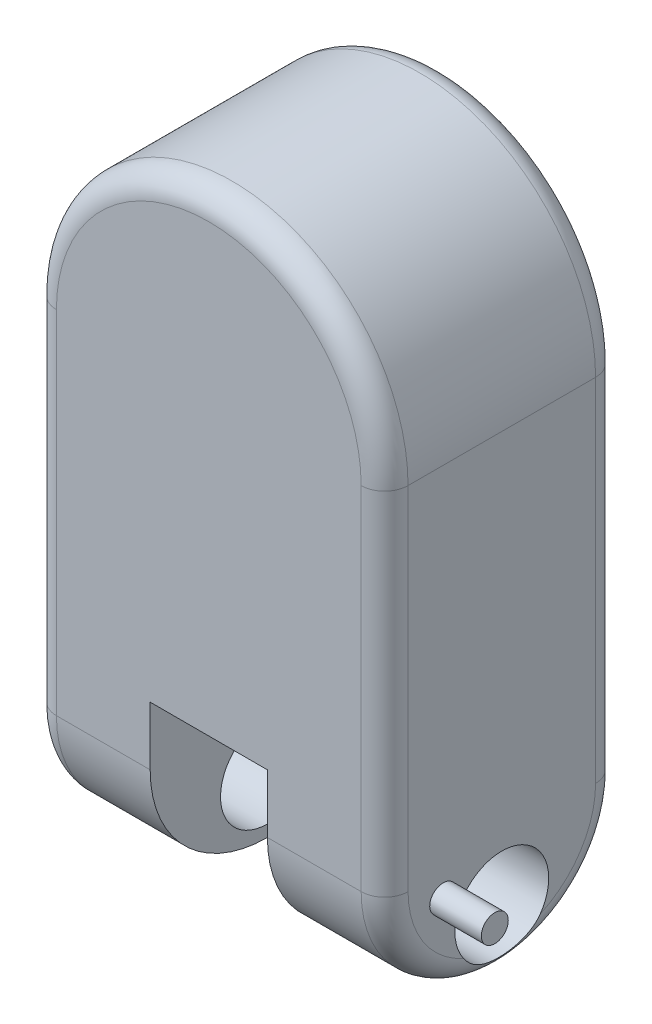
ISO-10303-21;
HEADER;
FILE_DESCRIPTION(('STEP AP214'),'2;1');
FILE_NAME('part.step','',(''),(''),'','','');
FILE_SCHEMA(('AUTOMOTIVE_DESIGN { 1 0 10303 214 1 1 1 1 }'));
ENDSEC;
DATA;
#1=APPLICATION_CONTEXT('core data for automotive mechanical design processes');
#2=APPLICATION_PROTOCOL_DEFINITION('international standard','automotive_design',2000,#1);
#3=PRODUCT_CONTEXT('',#1,'mechanical');
#4=PRODUCT('Part','Part','',(#3));
#5=PRODUCT_RELATED_PRODUCT_CATEGORY('part','',(#4));
#6=PRODUCT_DEFINITION_FORMATION('','',#4);
#7=PRODUCT_DEFINITION_CONTEXT('part definition',#1,'design');
#8=PRODUCT_DEFINITION('design','',#6,#7);
#9=PRODUCT_DEFINITION_SHAPE('','',#8);
#10=(LENGTH_UNIT() NAMED_UNIT(*) SI_UNIT(.MILLI.,.METRE.));
#11=(NAMED_UNIT(*) PLANE_ANGLE_UNIT() SI_UNIT($,.RADIAN.));
#12=(NAMED_UNIT(*) SI_UNIT($,.STERADIAN.) SOLID_ANGLE_UNIT());
#13=UNCERTAINTY_MEASURE_WITH_UNIT(LENGTH_MEASURE(1.E-05),#10,'distance_accuracy_value','');
#14=(GEOMETRIC_REPRESENTATION_CONTEXT(3) GLOBAL_UNCERTAINTY_ASSIGNED_CONTEXT((#13)) GLOBAL_UNIT_ASSIGNED_CONTEXT((#10,
#11,#12)) REPRESENTATION_CONTEXT('',''));
#15=CARTESIAN_POINT('',(0.,0.,0.));
#16=DIRECTION('',(0.,0.,1.));
#17=DIRECTION('',(1.,0.,0.));
#18=AXIS2_PLACEMENT_3D('',#15,#16,#17);
#19=CARTESIAN_POINT('',(-25.,-50.,-100.1));
#20=DIRECTION('',(0.,-1.,0.));
#21=DIRECTION('',(0.,0.,-1.));
#22=AXIS2_PLACEMENT_3D('',#19,#20,#21);
#23=PLANE('',#22);
#24=DIRECTION('',(1.,0.,0.));
#25=VECTOR('',#24,1.);
#26=CARTESIAN_POINT('',(-25.,-50.,-100.));
#27=LINE('',#26,#25);
#28=CARTESIAN_POINT('',(-25.,-50.,-100.));
#29=VERTEX_POINT('',#28);
#30=CARTESIAN_POINT('',(25.,-50.,-100.));
#31=VERTEX_POINT('',#30);
#32=EDGE_CURVE('E95',#29,#31,#27,.T.);
#33=ORIENTED_EDGE('',*,*,#32,.T.);
#34=CARTESIAN_POINT('',(23.5893264020334,-50.,-90.1));
#35=DIRECTION('',(0.,-1.,0.));
#36=DIRECTION('',(0.,0.,-1.));
#37=AXIS2_PLACEMENT_3D('',#34,#35,#36);
#38=CIRCLE('',#37,10.);
#39=CARTESIAN_POINT('',(23.5893264020334,-50.,-100.1));
#40=VERTEX_POINT('',#39);
#41=EDGE_CURVE('E12',#31,#40,#38,.F.);
#42=ORIENTED_EDGE('',*,*,#41,.T.);
#43=DIRECTION('',(1.,0.,0.));
#44=VECTOR('',#43,1.);
#45=CARTESIAN_POINT('',(-25.,-50.,-100.1));
#46=LINE('',#45,#44);
#47=CARTESIAN_POINT('',(-23.5893264020334,-50.,-100.1));
#48=VERTEX_POINT('',#47);
#49=EDGE_CURVE('E119',#48,#40,#46,.T.);
#50=ORIENTED_EDGE('',*,*,#49,.F.);
#51=CARTESIAN_POINT('',(-23.5893264020334,-50.,-90.1));
#52=DIRECTION('',(0.,-1.,0.));
#53=DIRECTION('',(0.,0.,-1.));
#54=AXIS2_PLACEMENT_3D('',#51,#52,#53);
#55=CIRCLE('',#54,10.);
#56=EDGE_CURVE('E58',#48,#29,#55,.F.);
#57=ORIENTED_EDGE('',*,*,#56,.T.);
#58=EDGE_LOOP('',(#33,#42,#50,#57));
#59=FACE_BOUND('',#58,.T.);
#60=ADVANCED_FACE('F49',(#59),#23,.F.);
#61=CARTESIAN_POINT('',(0.,0.,-100.1));
#62=DIRECTION('',(0.,0.,-1.));
#63=DIRECTION('',(-1.,0.,0.));
#64=AXIS2_PLACEMENT_3D('',#61,#62,#63);
#65=PLANE('',#64);
#66=ORIENTED_EDGE('',*,*,#49,.T.);
#67=DIRECTION('',(0.,1.,0.));
#68=VECTOR('',#67,1.);
#69=CARTESIAN_POINT('',(23.5893264020333,-80.,-100.1));
#70=LINE('',#69,#68);
#71=CARTESIAN_POINT('',(23.5893264020333,-78.5893264020334,-100.1));
#72=VERTEX_POINT('',#71);
#73=EDGE_CURVE('E107',#40,#72,#70,.F.);
#74=ORIENTED_EDGE('',*,*,#73,.T.);
#75=DIRECTION('',(1.,0.,0.));
#76=VECTOR('',#75,1.);
#77=CARTESIAN_POINT('',(-25.,-78.5893264020334,-100.1));
#78=LINE('',#77,#76);
#79=CARTESIAN_POINT('',(-23.5893264020334,-78.5893264020334,-100.1));
#80=VERTEX_POINT('',#79);
#81=EDGE_CURVE('E73',#72,#80,#78,.F.);
#82=ORIENTED_EDGE('',*,*,#81,.T.);
#83=DIRECTION('',(0.,-1.,0.));
#84=VECTOR('',#83,1.);
#85=CARTESIAN_POINT('',(-23.5893264020334,-50.,-100.1));
#86=LINE('',#85,#84);
#87=EDGE_CURVE('E110',#80,#48,#86,.F.);
#88=ORIENTED_EDGE('',*,*,#87,.T.);
#89=EDGE_LOOP('',(#66,#74,#82,#88));
#90=FACE_BOUND('',#89,.T.);
#91=ADVANCED_FACE('F123',(#90),#65,.T.);
#92=CARTESIAN_POINT('',(0.,0.,-100.));
#93=DIRECTION('',(0.,0.,-1.));
#94=DIRECTION('',(-1.,0.,0.));
#95=AXIS2_PLACEMENT_3D('',#92,#93,#94);
#96=PLANE('',#95);
#97=ORIENTED_EDGE('',*,*,#32,.F.);
#98=DIRECTION('',(0.,1.,0.));
#99=VECTOR('',#98,1.);
#100=CARTESIAN_POINT('',(-25.,-80.,-100.));
#101=LINE('',#100,#99);
#102=CARTESIAN_POINT('',(-25.,-80.,-100.));
#103=VERTEX_POINT('',#102);
#104=EDGE_CURVE('E118',#103,#29,#101,.T.);
#105=ORIENTED_EDGE('',*,*,#104,.F.);
#106=DIRECTION('',(-1.,0.,0.));
#107=VECTOR('',#106,1.);
#108=CARTESIAN_POINT('',(25.,-80.,-100.));
#109=LINE('',#108,#107);
#110=CARTESIAN_POINT('',(25.,-80.,-100.));
#111=VERTEX_POINT('',#110);
#112=EDGE_CURVE('E98',#111,#103,#109,.T.);
#113=ORIENTED_EDGE('',*,*,#112,.F.);
#114=DIRECTION('',(0.,-1.,0.));
#115=VECTOR('',#114,1.);
#116=CARTESIAN_POINT('',(25.,-50.,-100.));
#117=LINE('',#116,#115);
#118=EDGE_CURVE('E92',#31,#111,#117,.T.);
#119=ORIENTED_EDGE('',*,*,#118,.F.);
#120=EDGE_LOOP('',(#97,#105,#113,#119));
#121=FACE_BOUND('',#120,.T.);
#122=ADVANCED_FACE('F94',(#121),#96,.F.);
#123=CARTESIAN_POINT('',(-23.5893264020334,-80.,-90.1));
#124=DIRECTION('',(0.,1.,0.));
#125=DIRECTION('',(0.,0.,1.));
#126=AXIS2_PLACEMENT_3D('',#123,#124,#125);
#127=CYLINDRICAL_SURFACE('',#126,10.);
#128=ORIENTED_EDGE('',*,*,#56,.F.);
#129=ORIENTED_EDGE('',*,*,#87,.F.);
#130=CARTESIAN_POINT('',(-23.5893264020334,-78.5893264020334,-90.1));
#131=DIRECTION('',(-0.707106781186547,0.707106781186547,0.));
#132=DIRECTION('',(0.707106781186547,0.707106781186547,0.));
#133=AXIS2_PLACEMENT_3D('',#130,#131,#132);
#134=ELLIPSE('',#133,14.1421356237309,10.);
#135=EDGE_CURVE('E53',#103,#80,#134,.F.);
#136=ORIENTED_EDGE('',*,*,#135,.F.);
#137=ORIENTED_EDGE('',*,*,#104,.T.);
#138=EDGE_LOOP('',(#128,#129,#136,#137));
#139=FACE_BOUND('',#138,.T.);
#140=ADVANCED_FACE('F51',(#139),#127,.T.);
#141=CARTESIAN_POINT('',(25.,-78.5893264020334,-90.1));
#142=DIRECTION('',(-1.,0.,0.));
#143=DIRECTION('',(0.,0.,1.));
#144=AXIS2_PLACEMENT_3D('',#141,#142,#143);
#145=CYLINDRICAL_SURFACE('',#144,10.);
#146=ORIENTED_EDGE('',*,*,#135,.T.);
#147=ORIENTED_EDGE('',*,*,#81,.F.);
#148=CARTESIAN_POINT('',(23.5893264020333,-78.5893264020334,-90.1));
#149=DIRECTION('',(-0.707106781186548,-0.707106781186547,0.));
#150=DIRECTION('',(-0.707106781186547,0.707106781186548,0.));
#151=AXIS2_PLACEMENT_3D('',#148,#149,#150);
#152=ELLIPSE('',#151,14.1421356237309,10.);
#153=EDGE_CURVE('E66',#111,#72,#152,.F.);
#154=ORIENTED_EDGE('',*,*,#153,.F.);
#155=ORIENTED_EDGE('',*,*,#112,.T.);
#156=EDGE_LOOP('',(#146,#147,#154,#155));
#157=FACE_BOUND('',#156,.T.);
#158=ADVANCED_FACE('F116',(#157),#145,.T.);
#159=CARTESIAN_POINT('',(23.5893264020334,-50.,-90.1));
#160=DIRECTION('',(0.,-1.,0.));
#161=DIRECTION('',(1.,0.,0.));
#162=AXIS2_PLACEMENT_3D('',#159,#160,#161);
#163=CYLINDRICAL_SURFACE('',#162,10.);
#164=ORIENTED_EDGE('',*,*,#41,.F.);
#165=ORIENTED_EDGE('',*,*,#118,.T.);
#166=ORIENTED_EDGE('',*,*,#153,.T.);
#167=ORIENTED_EDGE('',*,*,#73,.F.);
#168=EDGE_LOOP('',(#164,#165,#166,#167));
#169=FACE_BOUND('',#168,.T.);
#170=ADVANCED_FACE('F106',(#169),#163,.T.);
#171=CLOSED_SHELL('',(#60,#91,#122,#140,#158,#170));
#172=MANIFOLD_SOLID_BREP('B2',#171);
#173=CARTESIAN_POINT('',(0.,-50.,-50.));
#174=DIRECTION('',(1.,0.,0.));
#175=DIRECTION('',(0.,0.,-1.));
#176=AXIS2_PLACEMENT_3D('',#173,#174,#175);
#177=CYLINDRICAL_SURFACE('',#176,50.);
#178=DIRECTION('',(1.,0.,0.));
#179=VECTOR('',#178,1.);
#180=CARTESIAN_POINT('',(0.,-50.,0.));
#181=LINE('',#180,#179);
#182=CARTESIAN_POINT('',(-65.,-50.,0.));
#183=VERTEX_POINT('',#182);
#184=CARTESIAN_POINT('',(-25.,-50.,0.));
#185=VERTEX_POINT('',#184);
#186=EDGE_CURVE('E373',#183,#185,#181,.T.);
#187=ORIENTED_EDGE('',*,*,#186,.F.);
#188=CARTESIAN_POINT('',(-65.,-50.,-50.));
#189=DIRECTION('',(-1.,0.,0.));
#190=DIRECTION('',(0.,-1.,0.));
#191=AXIS2_PLACEMENT_3D('',#188,#189,#190);
#192=CIRCLE('',#191,50.);
#193=CARTESIAN_POINT('',(-65.,-100.,-50.));
#194=VERTEX_POINT('',#193);
#195=EDGE_CURVE('E195',#183,#194,#192,.F.);
#196=ORIENTED_EDGE('',*,*,#195,.T.);
#197=DIRECTION('',(1.,0.,0.));
#198=VECTOR('',#197,1.);
#199=CARTESIAN_POINT('',(-75.,-100.,-50.));
#200=LINE('',#199,#198);
#201=CARTESIAN_POINT('',(-25.,-100.,-50.));
#202=VERTEX_POINT('',#201);
#203=EDGE_CURVE('E340',#202,#194,#200,.F.);
#204=ORIENTED_EDGE('',*,*,#203,.F.);
#205=CARTESIAN_POINT('',(-25.,-50.,-50.));
#206=DIRECTION('',(-1.,0.,0.));
#207=DIRECTION('',(0.,0.,1.));
#208=AXIS2_PLACEMENT_3D('',#205,#206,#207);
#209=CIRCLE('',#208,50.);
#210=EDGE_CURVE('E355',#185,#202,#209,.F.);
#211=ORIENTED_EDGE('',*,*,#210,.F.);
#212=EDGE_LOOP('',(#187,#196,#204,#211));
#213=FACE_BOUND('',#212,.T.);
#214=ADVANCED_FACE('F173',(#213),#177,.T.);
#215=CARTESIAN_POINT('',(-75.,-50.,-50.));
#216=DIRECTION('',(-1.,0.,0.));
#217=DIRECTION('',(0.,0.,1.));
#218=AXIS2_PLACEMENT_3D('',#215,#216,#217);
#219=CYLINDRICAL_SURFACE('',#218,50.);
#220=ORIENTED_EDGE('',*,*,#203,.T.);
#221=CARTESIAN_POINT('',(-65.,-50.,-50.));
#222=DIRECTION('',(-1.,0.,0.));
#223=DIRECTION('',(0.,-1.,0.));
#224=AXIS2_PLACEMENT_3D('',#221,#222,#223);
#225=CIRCLE('',#224,50.);
#226=CARTESIAN_POINT('',(-65.,-50.,-100.));
#227=VERTEX_POINT('',#226);
#228=EDGE_CURVE('E181',#194,#227,#225,.F.);
#229=ORIENTED_EDGE('',*,*,#228,.T.);
#230=DIRECTION('',(1.,0.,0.));
#231=VECTOR('',#230,1.);
#232=CARTESIAN_POINT('',(-75.,-50.,-100.));
#233=LINE('',#232,#231);
#234=CARTESIAN_POINT('',(-25.,-50.,-100.));
#235=VERTEX_POINT('',#234);
#236=EDGE_CURVE('E369',#235,#227,#233,.F.);
#237=ORIENTED_EDGE('',*,*,#236,.F.);
#238=CARTESIAN_POINT('',(-25.,-50.,-50.));
#239=DIRECTION('',(-1.,0.,0.));
#240=DIRECTION('',(0.,0.,1.));
#241=AXIS2_PLACEMENT_3D('',#238,#239,#240);
#242=CIRCLE('',#241,50.);
#243=EDGE_CURVE('E361',#202,#235,#242,.F.);
#244=ORIENTED_EDGE('',*,*,#243,.F.);
#245=EDGE_LOOP('',(#220,#229,#237,#244));
#246=FACE_BOUND('',#245,.T.);
#247=ADVANCED_FACE('F472',(#246),#219,.T.);
#248=CARTESIAN_POINT('',(75.,100.,-100.));
#249=DIRECTION('',(1.,0.,0.));
#250=DIRECTION('',(0.,1.,0.));
#251=AXIS2_PLACEMENT_3D('',#248,#249,#250);
#252=PLANE('',#251);
#253=CARTESIAN_POINT('',(75.,-60.,-25.));
#254=DIRECTION('',(1.,0.,0.));
#255=DIRECTION('',(0.,1.,0.));
#256=AXIS2_PLACEMENT_3D('',#253,#254,#255);
#257=CIRCLE('',#256,5.75);
#258=CARTESIAN_POINT('',(75.,-54.25,-25.));
#259=VERTEX_POINT('',#258);
#260=EDGE_CURVE('E616',#259,#259,#257,.T.);
#261=ORIENTED_EDGE('',*,*,#260,.F.);
#262=EDGE_LOOP('',(#261));
#263=FACE_BOUND('',#262,.T.);
#264=CARTESIAN_POINT('',(75.,-50.,-50.));
#265=DIRECTION('',(1.,0.,0.));
#266=DIRECTION('',(0.,1.,0.));
#267=AXIS2_PLACEMENT_3D('',#264,#265,#266);
#268=CIRCLE('',#267,40.);
#269=CARTESIAN_POINT('',(75.,-86.5,-66.3630681719536));
#270=VERTEX_POINT('',#269);
#271=CARTESIAN_POINT('',(75.,-50.,-90.));
#272=VERTEX_POINT('',#271);
#273=EDGE_CURVE('E395',#270,#272,#268,.T.);
#274=ORIENTED_EDGE('',*,*,#273,.T.);
#275=DIRECTION('',(0.,1.,0.));
#276=VECTOR('',#275,1.);
#277=CARTESIAN_POINT('',(75.,100.,-90.));
#278=LINE('',#277,#276);
#279=CARTESIAN_POINT('',(75.,100.,-90.));
#280=VERTEX_POINT('',#279);
#281=EDGE_CURVE('E397',#272,#280,#278,.T.);
#282=ORIENTED_EDGE('',*,*,#281,.T.);
#283=DIRECTION('',(0.,0.,1.));
#284=VECTOR('',#283,1.);
#285=CARTESIAN_POINT('',(75.,100.,-100.));
#286=LINE('',#285,#284);
#287=CARTESIAN_POINT('',(75.,100.,-9.99999999999999));
#288=VERTEX_POINT('',#287);
#289=EDGE_CURVE('E351',#280,#288,#286,.T.);
#290=ORIENTED_EDGE('',*,*,#289,.T.);
#291=DIRECTION('',(0.,1.,0.));
#292=VECTOR('',#291,1.);
#293=CARTESIAN_POINT('',(75.,100.,-9.99999999999999));
#294=LINE('',#293,#292);
#295=CARTESIAN_POINT('',(75.,-50.,-10.));
#296=VERTEX_POINT('',#295);
#297=EDGE_CURVE('E391',#288,#296,#294,.F.);
#298=ORIENTED_EDGE('',*,*,#297,.T.);
#299=CARTESIAN_POINT('',(75.,-50.,-50.));
#300=DIRECTION('',(1.,0.,0.));
#301=DIRECTION('',(0.,1.,0.));
#302=AXIS2_PLACEMENT_3D('',#299,#300,#301);
#303=CIRCLE('',#302,40.);
#304=CARTESIAN_POINT('',(75.,-86.5,-33.6369318280464));
#305=VERTEX_POINT('',#304);
#306=EDGE_CURVE('E393',#296,#305,#303,.T.);
#307=ORIENTED_EDGE('',*,*,#306,.T.);
#308=CARTESIAN_POINT('',(75.,-75.,-50.));
#309=DIRECTION('',(-1.,0.,0.));
#310=DIRECTION('',(0.,-1.,0.));
#311=AXIS2_PLACEMENT_3D('',#308,#309,#310);
#312=CIRCLE('',#311,20.);
#313=EDGE_CURVE('E341',#305,#270,#312,.T.);
#314=ORIENTED_EDGE('',*,*,#313,.T.);
#315=EDGE_LOOP('',(#274,#282,#290,#298,#307,#314));
#316=FACE_BOUND('',#315,.T.);
#317=ADVANCED_FACE('F477',(#263,#316),#252,.T.);
#318=CARTESIAN_POINT('',(-75.,100.,-100.));
#319=DIRECTION('',(-1.,0.,0.));
#320=DIRECTION('',(0.,-1.,0.));
#321=AXIS2_PLACEMENT_3D('',#318,#319,#320);
#322=PLANE('',#321);
#323=CARTESIAN_POINT('',(-75.,-50.,-50.));
#324=DIRECTION('',(-1.,0.,0.));
#325=DIRECTION('',(0.,-1.,0.));
#326=AXIS2_PLACEMENT_3D('',#323,#324,#325);
#327=CIRCLE('',#326,40.);
#328=CARTESIAN_POINT('',(-75.,-86.5,-33.6369318280464));
#329=VERTEX_POINT('',#328);
#330=CARTESIAN_POINT('',(-75.,-50.,-10.));
#331=VERTEX_POINT('',#330);
#332=EDGE_CURVE('E545',#329,#331,#327,.T.);
#333=ORIENTED_EDGE('',*,*,#332,.T.);
#334=DIRECTION('',(0.,-1.,0.));
#335=VECTOR('',#334,1.);
#336=CARTESIAN_POINT('',(-75.,100.,-9.99999999999999));
#337=LINE('',#336,#335);
#338=CARTESIAN_POINT('',(-75.,100.,-9.99999999999999));
#339=VERTEX_POINT('',#338);
#340=EDGE_CURVE('E443',#331,#339,#337,.F.);
#341=ORIENTED_EDGE('',*,*,#340,.T.);
#342=DIRECTION('',(0.,0.,1.));
#343=VECTOR('',#342,1.);
#344=CARTESIAN_POINT('',(-75.,100.,-100.));
#345=LINE('',#344,#343);
#346=CARTESIAN_POINT('',(-75.,100.,-90.));
#347=VERTEX_POINT('',#346);
#348=EDGE_CURVE('E352',#347,#339,#345,.T.);
#349=ORIENTED_EDGE('',*,*,#348,.F.);
#350=DIRECTION('',(0.,-1.,0.));
#351=VECTOR('',#350,1.);
#352=CARTESIAN_POINT('',(-75.,-50.,-90.));
#353=LINE('',#352,#351);
#354=CARTESIAN_POINT('',(-75.,-50.,-90.));
#355=VERTEX_POINT('',#354);
#356=EDGE_CURVE('E539',#347,#355,#353,.T.);
#357=ORIENTED_EDGE('',*,*,#356,.T.);
#358=CARTESIAN_POINT('',(-75.,-50.,-50.));
#359=DIRECTION('',(-1.,0.,0.));
#360=DIRECTION('',(0.,-1.,0.));
#361=AXIS2_PLACEMENT_3D('',#358,#359,#360);
#362=CIRCLE('',#361,40.);
#363=CARTESIAN_POINT('',(-75.,-86.5,-66.3630681719536));
#364=VERTEX_POINT('',#363);
#365=EDGE_CURVE('E544',#355,#364,#362,.T.);
#366=ORIENTED_EDGE('',*,*,#365,.T.);
#367=CARTESIAN_POINT('',(-75.,-75.,-50.));
#368=DIRECTION('',(-1.,0.,0.));
#369=DIRECTION('',(0.,-1.,0.));
#370=AXIS2_PLACEMENT_3D('',#367,#368,#369);
#371=CIRCLE('',#370,20.);
#372=EDGE_CURVE('E345',#329,#364,#371,.T.);
#373=ORIENTED_EDGE('',*,*,#372,.F.);
#374=EDGE_LOOP('',(#333,#341,#349,#357,#366,#373));
#375=FACE_BOUND('',#374,.T.);
#376=ADVANCED_FACE('F550',(#375),#322,.T.);
#377=CARTESIAN_POINT('',(0.,0.,-100.));
#378=DIRECTION('',(0.,0.,1.));
#379=DIRECTION('',(1.,0.,0.));
#380=AXIS2_PLACEMENT_3D('',#377,#378,#379);
#381=PLANE('',#380);
#382=CARTESIAN_POINT('',(0.,100.,-100.));
#383=DIRECTION('',(0.,0.,1.));
#384=DIRECTION('',(1.,0.,0.));
#385=AXIS2_PLACEMENT_3D('',#382,#383,#384);
#386=CIRCLE('',#385,65.);
#387=CARTESIAN_POINT('',(-65.,100.,-100.));
#388=VERTEX_POINT('',#387);
#389=CARTESIAN_POINT('',(65.,100.,-100.));
#390=VERTEX_POINT('',#389);
#391=EDGE_CURVE('E386',#388,#390,#386,.F.);
#392=ORIENTED_EDGE('',*,*,#391,.T.);
#393=DIRECTION('',(0.,1.,0.));
#394=VECTOR('',#393,1.);
#395=CARTESIAN_POINT('',(65.,-50.,-100.));
#396=LINE('',#395,#394);
#397=CARTESIAN_POINT('',(65.,-50.,-100.));
#398=VERTEX_POINT('',#397);
#399=EDGE_CURVE('E389',#390,#398,#396,.F.);
#400=ORIENTED_EDGE('',*,*,#399,.T.);
#401=CARTESIAN_POINT('',(25.,-50.,-100.));
#402=VERTEX_POINT('',#401);
#403=EDGE_CURVE('E374',#398,#402,#233,.F.);
#404=ORIENTED_EDGE('',*,*,#403,.T.);
#405=DIRECTION('',(-1.,0.,0.));
#406=VECTOR('',#405,1.);
#407=CARTESIAN_POINT('',(-25.,-50.,-100.));
#408=LINE('',#407,#406);
#409=EDGE_CURVE('E334',#402,#235,#408,.T.);
#410=ORIENTED_EDGE('',*,*,#409,.T.);
#411=ORIENTED_EDGE('',*,*,#236,.T.);
#412=DIRECTION('',(0.,-1.,0.));
#413=VECTOR('',#412,1.);
#414=CARTESIAN_POINT('',(-65.,100.,-100.));
#415=LINE('',#414,#413);
#416=EDGE_CURVE('E384',#227,#388,#415,.F.);
#417=ORIENTED_EDGE('',*,*,#416,.T.);
#418=EDGE_LOOP('',(#392,#400,#404,#410,#411,#417));
#419=FACE_BOUND('',#418,.T.);
#420=ADVANCED_FACE('F589',(#419),#381,.F.);
#421=CARTESIAN_POINT('',(0.,0.,0.));
#422=DIRECTION('',(0.,0.,1.));
#423=DIRECTION('',(1.,0.,0.));
#424=AXIS2_PLACEMENT_3D('',#421,#422,#423);
#425=PLANE('',#424);
#426=DIRECTION('',(0.,-1.,0.));
#427=VECTOR('',#426,1.);
#428=CARTESIAN_POINT('',(-25.,-50.,0.));
#429=LINE('',#428,#427);
#430=CARTESIAN_POINT('',(-25.,-25.,0.));
#431=VERTEX_POINT('',#430);
#432=EDGE_CURVE('E317',#431,#185,#429,.T.);
#433=ORIENTED_EDGE('',*,*,#432,.F.);
#434=DIRECTION('',(-1.,0.,0.));
#435=VECTOR('',#434,1.);
#436=CARTESIAN_POINT('',(-25.,-25.,0.));
#437=LINE('',#436,#435);
#438=CARTESIAN_POINT('',(25.,-25.,0.));
#439=VERTEX_POINT('',#438);
#440=EDGE_CURVE('E325',#439,#431,#437,.T.);
#441=ORIENTED_EDGE('',*,*,#440,.F.);
#442=DIRECTION('',(0.,1.,0.));
#443=VECTOR('',#442,1.);
#444=CARTESIAN_POINT('',(25.,-25.,0.));
#445=LINE('',#444,#443);
#446=CARTESIAN_POINT('',(25.,-50.,0.));
#447=VERTEX_POINT('',#446);
#448=EDGE_CURVE('E308',#447,#439,#445,.T.);
#449=ORIENTED_EDGE('',*,*,#448,.F.);
#450=CARTESIAN_POINT('',(65.,-50.,0.));
#451=VERTEX_POINT('',#450);
#452=EDGE_CURVE('E376',#447,#451,#181,.T.);
#453=ORIENTED_EDGE('',*,*,#452,.T.);
#454=DIRECTION('',(0.,1.,0.));
#455=VECTOR('',#454,1.);
#456=CARTESIAN_POINT('',(65.,0.,0.));
#457=LINE('',#456,#455);
#458=CARTESIAN_POINT('',(65.,100.,0.));
#459=VERTEX_POINT('',#458);
#460=EDGE_CURVE('E530',#451,#459,#457,.T.);
#461=ORIENTED_EDGE('',*,*,#460,.T.);
#462=CARTESIAN_POINT('',(0.,100.,0.));
#463=DIRECTION('',(0.,0.,1.));
#464=DIRECTION('',(1.,0.,0.));
#465=AXIS2_PLACEMENT_3D('',#462,#463,#464);
#466=CIRCLE('',#465,65.);
#467=CARTESIAN_POINT('',(-65.,100.,0.));
#468=VERTEX_POINT('',#467);
#469=EDGE_CURVE('E535',#459,#468,#466,.T.);
#470=ORIENTED_EDGE('',*,*,#469,.T.);
#471=DIRECTION('',(0.,-1.,0.));
#472=VECTOR('',#471,1.);
#473=CARTESIAN_POINT('',(-65.,0.,0.));
#474=LINE('',#473,#472);
#475=EDGE_CURVE('E504',#468,#183,#474,.T.);
#476=ORIENTED_EDGE('',*,*,#475,.T.);
#477=ORIENTED_EDGE('',*,*,#186,.T.);
#478=EDGE_LOOP('',(#433,#441,#449,#453,#461,#470,#476,#477));
#479=FACE_BOUND('',#478,.T.);
#480=ADVANCED_FACE('F599',(#479),#425,.T.);
#481=CARTESIAN_POINT('',(25.,-125.,-100.));
#482=DIRECTION('',(1.,0.,0.));
#483=DIRECTION('',(0.,0.,-1.));
#484=AXIS2_PLACEMENT_3D('',#481,#482,#483);
#485=PLANE('',#484);
#486=CARTESIAN_POINT('',(25.,-50.,-50.));
#487=DIRECTION('',(1.,0.,0.));
#488=DIRECTION('',(0.,0.,-1.));
#489=AXIS2_PLACEMENT_3D('',#486,#487,#488);
#490=CIRCLE('',#489,50.);
#491=CARTESIAN_POINT('',(25.,-100.,-50.));
#492=VERTEX_POINT('',#491);
#493=EDGE_CURVE('E364',#492,#447,#490,.F.);
#494=ORIENTED_EDGE('',*,*,#493,.T.);
#495=ORIENTED_EDGE('',*,*,#448,.T.);
#496=DIRECTION('',(0.,0.,1.));
#497=VECTOR('',#496,1.);
#498=CARTESIAN_POINT('',(25.,-25.,-99.));
#499=LINE('',#498,#497);
#500=CARTESIAN_POINT('',(25.,-25.,-99.));
#501=VERTEX_POINT('',#500);
#502=EDGE_CURVE('E300',#501,#439,#499,.T.);
#503=ORIENTED_EDGE('',*,*,#502,.F.);
#504=DIRECTION('',(0.,1.,0.));
#505=VECTOR('',#504,1.);
#506=CARTESIAN_POINT('',(25.,-25.,-99.));
#507=LINE('',#506,#505);
#508=CARTESIAN_POINT('',(25.,-49.4302970896538,-99.));
#509=VERTEX_POINT('',#508);
#510=EDGE_CURVE('E306',#509,#501,#507,.T.);
#511=ORIENTED_EDGE('',*,*,#510,.F.);
#512=CARTESIAN_POINT('',(25.,-136.602540378444,-50.));
#513=DIRECTION('',(1.,0.,0.));
#514=DIRECTION('',(0.,0.,-1.));
#515=AXIS2_PLACEMENT_3D('',#512,#513,#514);
#516=CIRCLE('',#515,100.);
#517=EDGE_CURVE('E335',#402,#509,#516,.T.);
#518=ORIENTED_EDGE('',*,*,#517,.F.);
#519=CARTESIAN_POINT('',(25.,-50.,-50.));
#520=DIRECTION('',(1.,0.,0.));
#521=DIRECTION('',(0.,0.,-1.));
#522=AXIS2_PLACEMENT_3D('',#519,#520,#521);
#523=CIRCLE('',#522,50.);
#524=EDGE_CURVE('E366',#402,#492,#523,.F.);
#525=ORIENTED_EDGE('',*,*,#524,.T.);
#526=EDGE_LOOP('',(#494,#495,#503,#511,#518,#525));
#527=FACE_BOUND('',#526,.T.);
#528=CARTESIAN_POINT('',(25.,-75.,-50.));
#529=DIRECTION('',(1.,0.,0.));
#530=DIRECTION('',(0.,0.,-1.));
#531=AXIS2_PLACEMENT_3D('',#528,#529,#530);
#532=CIRCLE('',#531,20.);
#533=CARTESIAN_POINT('',(25.,-75.,-70.));
#534=VERTEX_POINT('',#533);
#535=EDGE_CURVE('E348',#534,#534,#532,.T.);
#536=ORIENTED_EDGE('',*,*,#535,.T.);
#537=EDGE_LOOP('',(#536));
#538=FACE_BOUND('',#537,.T.);
#539=ADVANCED_FACE('F303',(#527,#538),#485,.F.);
#540=CARTESIAN_POINT('',(-25.,-125.,-100.));
#541=DIRECTION('',(-1.,0.,0.));
#542=DIRECTION('',(0.,0.,1.));
#543=AXIS2_PLACEMENT_3D('',#540,#541,#542);
#544=PLANE('',#543);
#545=ORIENTED_EDGE('',*,*,#432,.T.);
#546=ORIENTED_EDGE('',*,*,#210,.T.);
#547=ORIENTED_EDGE('',*,*,#243,.T.);
#548=CARTESIAN_POINT('',(-25.,-136.602540378444,-50.));
#549=DIRECTION('',(1.,0.,0.));
#550=DIRECTION('',(0.,0.,-1.));
#551=AXIS2_PLACEMENT_3D('',#548,#549,#550);
#552=CIRCLE('',#551,100.);
#553=CARTESIAN_POINT('',(-25.,-49.4302970896538,-99.));
#554=VERTEX_POINT('',#553);
#555=EDGE_CURVE('E331',#235,#554,#552,.T.);
#556=ORIENTED_EDGE('',*,*,#555,.T.);
#557=DIRECTION('',(0.,-1.,0.));
#558=VECTOR('',#557,1.);
#559=CARTESIAN_POINT('',(-25.,-50.,-99.));
#560=LINE('',#559,#558);
#561=CARTESIAN_POINT('',(-25.,-25.,-99.));
#562=VERTEX_POINT('',#561);
#563=EDGE_CURVE('E188',#562,#554,#560,.T.);
#564=ORIENTED_EDGE('',*,*,#563,.F.);
#565=DIRECTION('',(0.,0.,1.));
#566=VECTOR('',#565,1.);
#567=CARTESIAN_POINT('',(-25.,-25.,-99.));
#568=LINE('',#567,#566);
#569=EDGE_CURVE('E313',#562,#431,#568,.T.);
#570=ORIENTED_EDGE('',*,*,#569,.T.);
#571=EDGE_LOOP('',(#545,#546,#547,#556,#564,#570));
#572=FACE_BOUND('',#571,.T.);
#573=CARTESIAN_POINT('',(-25.,-75.,-50.));
#574=DIRECTION('',(-1.,0.,0.));
#575=DIRECTION('',(0.,0.,1.));
#576=AXIS2_PLACEMENT_3D('',#573,#574,#575);
#577=CIRCLE('',#576,20.);
#578=CARTESIAN_POINT('',(-25.,-75.,-30.));
#579=VERTEX_POINT('',#578);
#580=EDGE_CURVE('E344',#579,#579,#577,.T.);
#581=ORIENTED_EDGE('',*,*,#580,.T.);
#582=EDGE_LOOP('',(#581));
#583=FACE_BOUND('',#582,.T.);
#584=ADVANCED_FACE('F428',(#572,#583),#544,.F.);
#585=CARTESIAN_POINT('',(75.,-75.,-50.));
#586=DIRECTION('',(-1.,0.,0.));
#587=DIRECTION('',(0.,-1.,0.));
#588=AXIS2_PLACEMENT_3D('',#585,#586,#587);
#589=CYLINDRICAL_SURFACE('',#588,20.);
#590=CARTESIAN_POINT('',(-75.,-86.5,-66.3630681719536));
#591=CARTESIAN_POINT('',(-74.9999944988369,-86.7176357862937,-66.2101150233158));
#592=CARTESIAN_POINT('',(-74.9972251505423,-86.9321820247623,-66.0528421805292));
#593=CARTESIAN_POINT('',(-74.9867556613727,-87.3547338877603,-65.7299474304971));
#594=CARTESIAN_POINT('',(-74.9790561221654,-87.5627403071429,-65.5643265442969));
#595=CARTESIAN_POINT('',(-74.9494718778201,-88.1761618147391,-65.0555886797702));
#596=CARTESIAN_POINT('',(-74.9210996400918,-88.5713253297654,-64.7003530754296));
#597=CARTESIAN_POINT('',(-74.8515096756831,-89.3308118956316,-63.9609577577296));
#598=CARTESIAN_POINT('',(-74.8103152955771,-89.6951894805873,-63.576851568469));
#599=CARTESIAN_POINT('',(-74.7190573029856,-90.3919502085838,-62.7815251896324));
#600=CARTESIAN_POINT('',(-74.6689923089183,-90.7243283553076,-62.3703007827167));
#601=CARTESIAN_POINT('',(-74.5631593930954,-91.3586189763568,-61.5187034560061));
#602=CARTESIAN_POINT('',(-74.5073357106278,-91.6601635821769,-61.0780636594513));
#603=CARTESIAN_POINT('',(-74.3940622995594,-92.2269934381917,-60.1742441935076));
#604=CARTESIAN_POINT('',(-74.3366125479803,-92.4922781756816,-59.7110642055319));
#605=CARTESIAN_POINT('',(-74.223501755816,-92.9850540297158,-58.7648363026767));
#606=CARTESIAN_POINT('',(-74.167840615512,-93.2125472561706,-58.2817894988468));
#607=CARTESIAN_POINT('',(-74.0614849028067,-93.6283633257279,-57.2985605452277));
#608=CARTESIAN_POINT('',(-74.0107905215469,-93.816684661646,-56.7983777369727));
#609=CARTESIAN_POINT('',(-73.914628020795,-94.1623352522272,-55.7553050669512));
#610=CARTESIAN_POINT('',(-73.8696146444547,-94.3173235958303,-55.2115959974652));
#611=CARTESIAN_POINT('',(-73.7912772213223,-94.5808561419918,-54.1121164115953));
#612=CARTESIAN_POINT('',(-73.7579530630838,-94.6894007873518,-53.5563460102591));
#613=CARTESIAN_POINT('',(-73.7183397843355,-94.8167523648337,-52.7160701639446));
#614=CARTESIAN_POINT('',(-73.7068534918599,-94.8533239412986,-52.434388327726));
#615=CARTESIAN_POINT('',(-73.6875556329067,-94.9144503803222,-51.869577925022));
#616=CARTESIAN_POINT('',(-73.6797440577708,-94.9390052711948,-51.586449361947));
#617=CARTESIAN_POINT('',(-73.6679366207012,-94.9760341632624,-51.0192418997108));
#618=CARTESIAN_POINT('',(-73.6639419207102,-94.988504485659,-50.7351627375597));
#619=CARTESIAN_POINT('',(-73.6598264732936,-95.0013273397729,-50.1666967726029));
#620=CARTESIAN_POINT('',(-73.6597058137055,-95.0016795967333,-49.882309962968));
#621=CARTESIAN_POINT('',(-73.6615493262836,-94.9959605824914,-49.5980542531014));
#622=B_SPLINE_CURVE_WITH_KNOTS('',3,(#590,#591,#592,#593,#594,#595,#596,#597,#598,#599,#600,
#601,#602,#603,#604,#605,#606,#607,#608,#609,#610,#611,#612,#613,#614,#615,#616,#617,#618,#619,
#620,#621),.UNSPECIFIED.,.F.,.F.,(4,2,2,2,2,2,2,2,2,2,2,2,2,2,2,4),(0.,0.797874642750549,
1.59565193352407,3.1899412608992,4.78134451960052,6.37299585463969,7.98184001143662,
9.59070691451072,11.1994839638915,12.8083229014095,14.5077128583875,16.2070866127463,
17.0596892460926,17.91228987052,18.7651499631725,19.6180293930039),.UNSPECIFIED.);
#623=CARTESIAN_POINT('',(-73.6602540378444,-95.,-50.));
#624=VERTEX_POINT('',#623);
#625=EDGE_CURVE('E435',#364,#624,#622,.T.);
#626=ORIENTED_EDGE('',*,*,#625,.T.);
#627=CARTESIAN_POINT('',(-73.6602540378444,-95.,-50.));
#628=CARTESIAN_POINT('',(-73.660247528865,-95.0000005574234,-49.7291162562174));
#629=CARTESIAN_POINT('',(-73.6620203059655,-94.9944957155756,-49.4582663052626));
#630=CARTESIAN_POINT('',(-73.6690632302412,-94.9724962896712,-48.9170644816353));
#631=CARTESIAN_POINT('',(-73.6743333002116,-94.9560019482144,-48.6467125980998));
#632=CARTESIAN_POINT('',(-73.6952902819852,-94.8900894423996,-47.8373209986367));
#633=CARTESIAN_POINT('',(-73.7161240917141,-94.8242417460367,-47.2996541799824));
#634=CARTESIAN_POINT('',(-73.7701739357349,-94.6495431926145,-46.2334838396406));
#635=CARTESIAN_POINT('',(-73.8033583037589,-94.5408022695238,-45.7049604702912));
#636=CARTESIAN_POINT('',(-73.8801161670473,-94.281208901752,-44.6590938773701));
#637=CARTESIAN_POINT('',(-73.9236903013259,-94.1303538667788,-44.1417513436021));
#638=CARTESIAN_POINT('',(-74.0189152913429,-93.7867894617178,-43.1189296044383));
#639=CARTESIAN_POINT('',(-74.0706068716683,-93.593867036125,-42.6135258599768));
#640=CARTESIAN_POINT('',(-74.1788835403941,-93.1679670726698,-41.6204488654864));
#641=CARTESIAN_POINT('',(-74.2354685830894,-92.9349899088994,-41.1327754499163));
#642=CARTESIAN_POINT('',(-74.3502215235499,-92.4304028734049,-40.1779497284365));
#643=CARTESIAN_POINT('',(-74.4083896442132,-92.1587875384141,-39.7108003367798));
#644=CARTESIAN_POINT('',(-74.5227473765823,-91.5785175374874,-38.7998012021265));
#645=CARTESIAN_POINT('',(-74.5789368427548,-91.269860154377,-38.3559531718098));
#646=CARTESIAN_POINT('',(-74.6878982994192,-90.6029124642454,-37.4753289636808));
#647=CARTESIAN_POINT('',(-74.740412180585,-90.243038677624,-37.0397174887075));
#648=CARTESIAN_POINT('',(-74.8345685865417,-89.4871384922569,-36.1999281519389));
#649=CARTESIAN_POINT('',(-74.8762127470129,-89.0911175450705,-35.7957455671454));
#650=CARTESIAN_POINT('',(-74.943772411168,-88.2643200754095,-35.0206968408248));
#651=CARTESIAN_POINT('',(-74.969646571122,-87.8334555217029,-34.6499204268788));
#652=CARTESIAN_POINT('',(-74.992406932906,-87.1642627834429,-34.1219764911395));
#653=CARTESIAN_POINT('',(-74.997317042392,-86.9372659175227,-33.9506217314705));
#654=CARTESIAN_POINT('',(-75.001019493978,-86.4761119092304,-33.6177002554482));
#655=CARTESIAN_POINT('',(-74.9998109947272,-86.2419537865366,-33.4561348882949));
#656=CARTESIAN_POINT('',(-74.9951651075579,-86.0044531883259,-33.299640422256));
#657=B_SPLINE_CURVE_WITH_KNOTS('',3,(#627,#628,#629,#630,#631,#632,#633,#634,#635,#636,#637,
#638,#639,#640,#641,#642,#643,#644,#645,#646,#647,#648,#649,#650,#651,#652,#653,#654,#655,#656),
.UNSPECIFIED.,.F.,.F.,(4,2,2,2,2,2,2,2,2,2,2,2,2,2,4),(0.,0.812522437824889,1.62502693931454,
3.24916534614429,4.86916790626038,6.48927012904759,8.1177764581638,9.74626757863837,
11.3749891898565,13.0038303470725,14.704137296452,16.404188235224,18.1086771866605,
18.9617565600298,19.8149532408673),.UNSPECIFIED.);
#658=EDGE_CURVE('E442',#624,#329,#657,.T.);
#659=ORIENTED_EDGE('',*,*,#658,.T.);
#660=ORIENTED_EDGE('',*,*,#372,.T.);
#661=EDGE_LOOP('',(#626,#659,#660));
#662=FACE_BOUND('',#661,.T.);
#663=ORIENTED_EDGE('',*,*,#580,.F.);
#664=EDGE_LOOP('',(#663));
#665=FACE_BOUND('',#664,.T.);
#666=ADVANCED_FACE('F424',(#662,#665),#589,.F.);
#667=CARTESIAN_POINT('',(75.,-86.5,-33.6369318280464));
#668=CARTESIAN_POINT('',(74.9999944988369,-86.7176357862937,-33.7898849766843));
#669=CARTESIAN_POINT('',(74.9972251505423,-86.9321820247623,-33.9471578194709));
#670=CARTESIAN_POINT('',(74.9867556613727,-87.3547338877603,-34.2700525695029));
#671=CARTESIAN_POINT('',(74.9790561221654,-87.5627403071429,-34.4356734557032));
#672=CARTESIAN_POINT('',(74.9494718778202,-88.1761618147391,-34.9444113202298));
#673=CARTESIAN_POINT('',(74.9210996400918,-88.5713253297655,-35.2996469245704));
#674=CARTESIAN_POINT('',(74.8515096756831,-89.3308118956316,-36.0390422422705));
#675=CARTESIAN_POINT('',(74.8103152955771,-89.6951894805874,-36.4231484315311));
#676=CARTESIAN_POINT('',(74.7190573029856,-90.3919502085838,-37.2184748103677));
#677=CARTESIAN_POINT('',(74.6689923089183,-90.7243283553076,-37.6296992172833));
#678=CARTESIAN_POINT('',(74.5631593930954,-91.3586189763569,-38.4812965439939));
#679=CARTESIAN_POINT('',(74.5073357106278,-91.6601635821769,-38.9219363405487));
#680=CARTESIAN_POINT('',(74.3940622995594,-92.2269934381917,-39.8257558064924));
#681=CARTESIAN_POINT('',(74.3366125479803,-92.4922781756816,-40.2889357944682));
#682=CARTESIAN_POINT('',(74.223501755816,-92.9850540297158,-41.2351636973234));
#683=CARTESIAN_POINT('',(74.1678406155121,-93.2125472561706,-41.7182105011532));
#684=CARTESIAN_POINT('',(74.0614849028068,-93.6283633257279,-42.7014394547723));
#685=CARTESIAN_POINT('',(74.0107905215469,-93.816684661646,-43.2016222630274));
#686=CARTESIAN_POINT('',(73.914628020795,-94.1623352522272,-44.2446949330489));
#687=CARTESIAN_POINT('',(73.8696146444547,-94.3173235958303,-44.7884040025349));
#688=CARTESIAN_POINT('',(73.7912772213223,-94.5808561419918,-45.8878835884048));
#689=CARTESIAN_POINT('',(73.7579530630838,-94.6894007873518,-46.443653989741));
#690=CARTESIAN_POINT('',(73.7183397843355,-94.8167523648337,-47.2839298360555));
#691=CARTESIAN_POINT('',(73.7068534918599,-94.8533239412986,-47.5656116722741));
#692=CARTESIAN_POINT('',(73.6875556329067,-94.9144503803222,-48.1304220749781));
#693=CARTESIAN_POINT('',(73.6797440577708,-94.9390052711947,-48.4135506380531));
#694=CARTESIAN_POINT('',(73.6679366207012,-94.9760341632624,-48.9807581002893));
#695=CARTESIAN_POINT('',(73.6639419207102,-94.9885044856589,-49.2648372624404));
#696=CARTESIAN_POINT('',(73.6598264732936,-95.0013273397729,-49.8333032273972));
#697=CARTESIAN_POINT('',(73.6597058137055,-95.0016795967332,-50.117690037032));
#698=CARTESIAN_POINT('',(73.6615493262836,-94.9959605824914,-50.4019457468986));
#699=B_SPLINE_CURVE_WITH_KNOTS('',3,(#667,#668,#669,#670,#671,#672,#673,#674,#675,#676,#677,
#678,#679,#680,#681,#682,#683,#684,#685,#686,#687,#688,#689,#690,#691,#692,#693,#694,#695,#696,
#697,#698),.UNSPECIFIED.,.F.,.F.,(4,2,2,2,2,2,2,2,2,2,2,2,2,2,2,4),(0.,0.797874642750549,
1.59565193352407,3.18994126089919,4.78134451960053,6.37299585463971,7.98184001143662,
9.59070691451073,11.1994839638915,12.8083229014096,14.5077128583875,16.2070866127463,
17.0596892460926,17.91228987052,18.7651499631725,19.6180293930039),.UNSPECIFIED.);
#700=CARTESIAN_POINT('',(73.6602540378444,-95.,-50.));
#701=VERTEX_POINT('',#700);
#702=EDGE_CURVE('E399',#305,#701,#699,.T.);
#703=ORIENTED_EDGE('',*,*,#702,.T.);
#704=CARTESIAN_POINT('',(73.6602540378444,-95.,-50.));
#705=CARTESIAN_POINT('',(73.660247528865,-95.0000005574234,-50.2708837437826));
#706=CARTESIAN_POINT('',(73.6620203059655,-94.9944957155756,-50.5417336947374));
#707=CARTESIAN_POINT('',(73.6690632302412,-94.9724962896711,-51.0829355183647));
#708=CARTESIAN_POINT('',(73.6743333002116,-94.9560019482144,-51.3532874019002));
#709=CARTESIAN_POINT('',(73.6952902819852,-94.8900894423996,-52.1626790013634));
#710=CARTESIAN_POINT('',(73.7161240917141,-94.8242417460367,-52.7003458200177));
#711=CARTESIAN_POINT('',(73.7701739357349,-94.6495431926144,-53.7665161603594));
#712=CARTESIAN_POINT('',(73.8033583037589,-94.5408022695237,-54.2950395297088));
#713=CARTESIAN_POINT('',(73.8801161670473,-94.281208901752,-55.3409061226299));
#714=CARTESIAN_POINT('',(73.9236903013259,-94.1303538667788,-55.8582486563979));
#715=CARTESIAN_POINT('',(74.0189152913429,-93.7867894617177,-56.8810703955617));
#716=CARTESIAN_POINT('',(74.0706068716683,-93.593867036125,-57.3864741400232));
#717=CARTESIAN_POINT('',(74.1788835403941,-93.1679670726698,-58.3795511345136));
#718=CARTESIAN_POINT('',(74.2354685830894,-92.9349899088993,-58.8672245500837));
#719=CARTESIAN_POINT('',(74.3502215235499,-92.4304028734048,-59.8220502715635));
#720=CARTESIAN_POINT('',(74.4083896442132,-92.1587875384141,-60.2891996632202));
#721=CARTESIAN_POINT('',(74.5227473765823,-91.5785175374873,-61.2001987978735));
#722=CARTESIAN_POINT('',(74.5789368427548,-91.269860154377,-61.6440468281903));
#723=CARTESIAN_POINT('',(74.6878982994192,-90.6029124642454,-62.5246710363192));
#724=CARTESIAN_POINT('',(74.740412180585,-90.243038677624,-62.9602825112925));
#725=CARTESIAN_POINT('',(74.8345685865417,-89.4871384922569,-63.8000718480611));
#726=CARTESIAN_POINT('',(74.8762127470129,-89.0911175450705,-64.2042544328546));
#727=CARTESIAN_POINT('',(74.943772411168,-88.2643200754095,-64.9793031591752));
#728=CARTESIAN_POINT('',(74.969646571122,-87.8334555217029,-65.3500795731212));
#729=CARTESIAN_POINT('',(74.992406932906,-87.1642627834429,-65.8780235088606));
#730=CARTESIAN_POINT('',(74.997317042392,-86.9372659175227,-66.0493782685295));
#731=CARTESIAN_POINT('',(75.001019493978,-86.4761119092304,-66.3822997445518));
#732=CARTESIAN_POINT('',(74.9998109947271,-86.2419537865366,-66.5438651117051));
#733=CARTESIAN_POINT('',(74.9951651075579,-86.0044531883259,-66.700359577744));
#734=B_SPLINE_CURVE_WITH_KNOTS('',3,(#704,#705,#706,#707,#708,#709,#710,#711,#712,#713,#714,
#715,#716,#717,#718,#719,#720,#721,#722,#723,#724,#725,#726,#727,#728,#729,#730,#731,#732,#733),
.UNSPECIFIED.,.F.,.F.,(4,2,2,2,2,2,2,2,2,2,2,2,2,2,4),(0.,0.81252243782489,1.62502693931456,
3.24916534614429,4.86916790626037,6.48927012904759,8.11777645816379,9.74626757863838,
11.3749891898565,13.0038303470725,14.704137296452,16.404188235224,18.1086771866605,
18.9617565600298,19.8149532408673),.UNSPECIFIED.);
#735=EDGE_CURVE('E407',#701,#270,#734,.T.);
#736=ORIENTED_EDGE('',*,*,#735,.T.);
#737=ORIENTED_EDGE('',*,*,#313,.F.);
#738=EDGE_LOOP('',(#703,#736,#737));
#739=FACE_BOUND('',#738,.T.);
#740=ORIENTED_EDGE('',*,*,#535,.F.);
#741=EDGE_LOOP('',(#740));
#742=FACE_BOUND('',#741,.T.);
#743=ADVANCED_FACE('F418',(#739,#742),#589,.F.);
#744=DIRECTION('',(1.,0.,0.));
#745=VECTOR('',#744,1.);
#746=CARTESIAN_POINT('',(50.,-100.,-50.));
#747=LINE('',#746,#745);
#748=CARTESIAN_POINT('',(65.,-100.,-50.));
#749=VERTEX_POINT('',#748);
#750=EDGE_CURVE('E370',#749,#492,#747,.F.);
#751=ORIENTED_EDGE('',*,*,#750,.F.);
#752=CARTESIAN_POINT('',(65.,-50.,-50.));
#753=DIRECTION('',(1.,0.,0.));
#754=DIRECTION('',(0.,1.,0.));
#755=AXIS2_PLACEMENT_3D('',#752,#753,#754);
#756=CIRCLE('',#755,50.);
#757=EDGE_CURVE('E492',#749,#451,#756,.F.);
#758=ORIENTED_EDGE('',*,*,#757,.T.);
#759=ORIENTED_EDGE('',*,*,#452,.F.);
#760=ORIENTED_EDGE('',*,*,#493,.F.);
#761=EDGE_LOOP('',(#751,#758,#759,#760));
#762=FACE_BOUND('',#761,.T.);
#763=ADVANCED_FACE('F423',(#762),#177,.T.);
#764=ORIENTED_EDGE('',*,*,#403,.F.);
#765=CARTESIAN_POINT('',(65.,-50.,-50.));
#766=DIRECTION('',(1.,0.,0.));
#767=DIRECTION('',(0.,1.,0.));
#768=AXIS2_PLACEMENT_3D('',#765,#766,#767);
#769=CIRCLE('',#768,50.);
#770=EDGE_CURVE('E505',#398,#749,#769,.F.);
#771=ORIENTED_EDGE('',*,*,#770,.T.);
#772=ORIENTED_EDGE('',*,*,#750,.T.);
#773=ORIENTED_EDGE('',*,*,#524,.F.);
#774=EDGE_LOOP('',(#764,#771,#772,#773));
#775=FACE_BOUND('',#774,.T.);
#776=ADVANCED_FACE('F480',(#775),#219,.T.);
#777=CARTESIAN_POINT('',(-25.,-136.602540378444,-50.));
#778=DIRECTION('',(1.,0.,0.));
#779=DIRECTION('',(0.,0.,-1.));
#780=AXIS2_PLACEMENT_3D('',#777,#778,#779);
#781=CYLINDRICAL_SURFACE('',#780,100.);
#782=ORIENTED_EDGE('',*,*,#517,.T.);
#783=DIRECTION('',(1.,0.,0.));
#784=VECTOR('',#783,1.);
#785=CARTESIAN_POINT('',(-25.,-49.4302970896538,-99.));
#786=LINE('',#785,#784);
#787=EDGE_CURVE('E47',#509,#554,#786,.F.);
#788=ORIENTED_EDGE('',*,*,#787,.T.);
#789=ORIENTED_EDGE('',*,*,#555,.F.);
#790=ORIENTED_EDGE('',*,*,#409,.F.);
#791=EDGE_LOOP('',(#782,#788,#789,#790));
#792=FACE_BOUND('',#791,.T.);
#793=ADVANCED_FACE('F426',(#792),#781,.F.);
#794=CARTESIAN_POINT('',(0.,100.,-100.));
#795=DIRECTION('',(0.,0.,1.));
#796=DIRECTION('',(1.,0.,0.));
#797=AXIS2_PLACEMENT_3D('',#794,#795,#796);
#798=CYLINDRICAL_SURFACE('',#797,75.);
#799=ORIENTED_EDGE('',*,*,#289,.F.);
#800=CARTESIAN_POINT('',(0.,100.,-90.));
#801=DIRECTION('',(0.,0.,1.));
#802=DIRECTION('',(1.,0.,0.));
#803=AXIS2_PLACEMENT_3D('',#800,#801,#802);
#804=CIRCLE('',#803,75.);
#805=EDGE_CURVE('E381',#280,#347,#804,.T.);
#806=ORIENTED_EDGE('',*,*,#805,.T.);
#807=ORIENTED_EDGE('',*,*,#348,.T.);
#808=CARTESIAN_POINT('',(0.,100.,-9.99999999999999));
#809=DIRECTION('',(0.,0.,1.));
#810=DIRECTION('',(1.,0.,0.));
#811=AXIS2_PLACEMENT_3D('',#808,#809,#810);
#812=CIRCLE('',#811,75.);
#813=EDGE_CURVE('E372',#339,#288,#812,.F.);
#814=ORIENTED_EDGE('',*,*,#813,.T.);
#815=EDGE_LOOP('',(#799,#806,#807,#814));
#816=FACE_BOUND('',#815,.T.);
#817=ADVANCED_FACE('F555',(#816),#798,.T.);
#818=CARTESIAN_POINT('',(0.,100.,-9.99999999999999));
#819=DIRECTION('',(0.,0.,1.));
#820=DIRECTION('',(1.,0.,0.));
#821=AXIS2_PLACEMENT_3D('',#818,#819,#820);
#822=TOROIDAL_SURFACE('',#821,65.,10.);
#823=CARTESIAN_POINT('',(-65.,100.,-10.));
#824=DIRECTION('',(0.,-1.,0.));
#825=DIRECTION('',(0.,0.,-1.));
#826=AXIS2_PLACEMENT_3D('',#823,#824,#825);
#827=CIRCLE('',#826,10.);
#828=EDGE_CURVE('E522',#468,#339,#827,.T.);
#829=ORIENTED_EDGE('',*,*,#828,.F.);
#830=ORIENTED_EDGE('',*,*,#469,.F.);
#831=CARTESIAN_POINT('',(65.,100.,-9.99999999999999));
#832=DIRECTION('',(0.,-1.,0.));
#833=DIRECTION('',(0.,0.,-1.));
#834=AXIS2_PLACEMENT_3D('',#831,#832,#833);
#835=CIRCLE('',#834,10.);
#836=EDGE_CURVE('E337',#288,#459,#835,.T.);
#837=ORIENTED_EDGE('',*,*,#836,.F.);
#838=ORIENTED_EDGE('',*,*,#813,.F.);
#839=EDGE_LOOP('',(#829,#830,#837,#838));
#840=FACE_BOUND('',#839,.T.);
#841=ADVANCED_FACE('F175',(#840),#822,.T.);
#842=CARTESIAN_POINT('',(65.,0.,-10.));
#843=DIRECTION('',(0.,1.,0.));
#844=DIRECTION('',(-1.,0.,0.));
#845=AXIS2_PLACEMENT_3D('',#842,#843,#844);
#846=CYLINDRICAL_SURFACE('',#845,10.);
#847=ORIENTED_EDGE('',*,*,#836,.T.);
#848=ORIENTED_EDGE('',*,*,#460,.F.);
#849=CARTESIAN_POINT('',(65.,-50.,-10.));
#850=DIRECTION('',(0.,-1.,0.));
#851=DIRECTION('',(0.,0.,-1.));
#852=AXIS2_PLACEMENT_3D('',#849,#850,#851);
#853=CIRCLE('',#852,10.);
#854=EDGE_CURVE('E503',#296,#451,#853,.T.);
#855=ORIENTED_EDGE('',*,*,#854,.F.);
#856=ORIENTED_EDGE('',*,*,#297,.F.);
#857=EDGE_LOOP('',(#847,#848,#855,#856));
#858=FACE_BOUND('',#857,.T.);
#859=ADVANCED_FACE('F529',(#858),#846,.T.);
#860=CARTESIAN_POINT('',(-65.,0.,-10.));
#861=DIRECTION('',(0.,-1.,0.));
#862=DIRECTION('',(1.,0.,0.));
#863=AXIS2_PLACEMENT_3D('',#860,#861,#862);
#864=CYLINDRICAL_SURFACE('',#863,10.);
#865=ORIENTED_EDGE('',*,*,#828,.T.);
#866=ORIENTED_EDGE('',*,*,#340,.F.);
#867=CARTESIAN_POINT('',(-65.,-50.,-10.));
#868=DIRECTION('',(0.,-1.,0.));
#869=DIRECTION('',(0.,0.,-1.));
#870=AXIS2_PLACEMENT_3D('',#867,#868,#869);
#871=CIRCLE('',#870,10.);
#872=EDGE_CURVE('E511',#183,#331,#871,.T.);
#873=ORIENTED_EDGE('',*,*,#872,.F.);
#874=ORIENTED_EDGE('',*,*,#475,.F.);
#875=EDGE_LOOP('',(#865,#866,#873,#874));
#876=FACE_BOUND('',#875,.T.);
#877=ADVANCED_FACE('F468',(#876),#864,.T.);
#878=CARTESIAN_POINT('',(65.,-50.,-50.));
#879=DIRECTION('',(1.,0.,0.));
#880=DIRECTION('',(0.,1.,0.));
#881=AXIS2_PLACEMENT_3D('',#878,#879,#880);
#882=TOROIDAL_SURFACE('',#881,40.,10.);
#883=ORIENTED_EDGE('',*,*,#854,.T.);
#884=ORIENTED_EDGE('',*,*,#757,.F.);
#885=CARTESIAN_POINT('',(65.,-90.,-50.));
#886=DIRECTION('',(0.,0.,-1.));
#887=DIRECTION('',(-1.,0.,0.));
#888=AXIS2_PLACEMENT_3D('',#885,#886,#887);
#889=CIRCLE('',#888,10.);
#890=EDGE_CURVE('E499',#701,#749,#889,.T.);
#891=ORIENTED_EDGE('',*,*,#890,.F.);
#892=ORIENTED_EDGE('',*,*,#702,.F.);
#893=ORIENTED_EDGE('',*,*,#306,.F.);
#894=EDGE_LOOP('',(#883,#884,#891,#892,#893));
#895=FACE_BOUND('',#894,.T.);
#896=ADVANCED_FACE('F414',(#895),#882,.T.);
#897=CARTESIAN_POINT('',(-65.,-50.,-50.));
#898=DIRECTION('',(-1.,0.,0.));
#899=DIRECTION('',(0.,-1.,0.));
#900=AXIS2_PLACEMENT_3D('',#897,#898,#899);
#901=TOROIDAL_SURFACE('',#900,40.,10.);
#902=ORIENTED_EDGE('',*,*,#332,.F.);
#903=ORIENTED_EDGE('',*,*,#658,.F.);
#904=CARTESIAN_POINT('',(-65.,-90.,-50.));
#905=DIRECTION('',(0.,0.,-1.));
#906=DIRECTION('',(-1.,0.,0.));
#907=AXIS2_PLACEMENT_3D('',#904,#905,#906);
#908=CIRCLE('',#907,10.);
#909=EDGE_CURVE('E512',#194,#624,#908,.T.);
#910=ORIENTED_EDGE('',*,*,#909,.F.);
#911=ORIENTED_EDGE('',*,*,#195,.F.);
#912=ORIENTED_EDGE('',*,*,#872,.T.);
#913=EDGE_LOOP('',(#902,#903,#910,#911,#912));
#914=FACE_BOUND('',#913,.T.);
#915=ADVANCED_FACE('F460',(#914),#901,.T.);
#916=CARTESIAN_POINT('',(65.,-50.,-50.));
#917=DIRECTION('',(1.,0.,0.));
#918=DIRECTION('',(0.,1.,0.));
#919=AXIS2_PLACEMENT_3D('',#916,#917,#918);
#920=TOROIDAL_SURFACE('',#919,40.,10.);
#921=ORIENTED_EDGE('',*,*,#890,.T.);
#922=ORIENTED_EDGE('',*,*,#770,.F.);
#923=CARTESIAN_POINT('',(65.,-50.,-90.));
#924=DIRECTION('',(0.,1.,0.));
#925=DIRECTION('',(0.,0.,1.));
#926=AXIS2_PLACEMENT_3D('',#923,#924,#925);
#927=CIRCLE('',#926,10.);
#928=EDGE_CURVE('E517',#272,#398,#927,.T.);
#929=ORIENTED_EDGE('',*,*,#928,.F.);
#930=ORIENTED_EDGE('',*,*,#273,.F.);
#931=ORIENTED_EDGE('',*,*,#735,.F.);
#932=EDGE_LOOP('',(#921,#922,#929,#930,#931));
#933=FACE_BOUND('',#932,.T.);
#934=ADVANCED_FACE('F455',(#933),#920,.T.);
#935=CARTESIAN_POINT('',(-65.,-50.,-50.));
#936=DIRECTION('',(-1.,0.,0.));
#937=DIRECTION('',(0.,-1.,0.));
#938=AXIS2_PLACEMENT_3D('',#935,#936,#937);
#939=TOROIDAL_SURFACE('',#938,40.,10.);
#940=ORIENTED_EDGE('',*,*,#625,.F.);
#941=ORIENTED_EDGE('',*,*,#365,.F.);
#942=CARTESIAN_POINT('',(-65.,-50.,-90.));
#943=DIRECTION('',(0.,1.,0.));
#944=DIRECTION('',(0.,0.,1.));
#945=AXIS2_PLACEMENT_3D('',#942,#943,#944);
#946=CIRCLE('',#945,10.);
#947=EDGE_CURVE('E571',#227,#355,#946,.T.);
#948=ORIENTED_EDGE('',*,*,#947,.F.);
#949=ORIENTED_EDGE('',*,*,#228,.F.);
#950=ORIENTED_EDGE('',*,*,#909,.T.);
#951=EDGE_LOOP('',(#940,#941,#948,#949,#950));
#952=FACE_BOUND('',#951,.T.);
#953=ADVANCED_FACE('F450',(#952),#939,.T.);
#954=CARTESIAN_POINT('',(65.,100.,-90.));
#955=DIRECTION('',(0.,-1.,0.));
#956=DIRECTION('',(1.,0.,0.));
#957=AXIS2_PLACEMENT_3D('',#954,#955,#956);
#958=CYLINDRICAL_SURFACE('',#957,10.);
#959=ORIENTED_EDGE('',*,*,#928,.T.);
#960=ORIENTED_EDGE('',*,*,#399,.F.);
#961=CARTESIAN_POINT('',(65.,100.,-90.));
#962=DIRECTION('',(0.,1.,0.));
#963=DIRECTION('',(0.,0.,1.));
#964=AXIS2_PLACEMENT_3D('',#961,#962,#963);
#965=CIRCLE('',#964,10.);
#966=EDGE_CURVE('E561',#280,#390,#965,.T.);
#967=ORIENTED_EDGE('',*,*,#966,.F.);
#968=ORIENTED_EDGE('',*,*,#281,.F.);
#969=EDGE_LOOP('',(#959,#960,#967,#968));
#970=FACE_BOUND('',#969,.T.);
#971=ADVANCED_FACE('F454',(#970),#958,.T.);
#972=CARTESIAN_POINT('',(-65.,100.,-90.));
#973=DIRECTION('',(0.,1.,0.));
#974=DIRECTION('',(-1.,0.,0.));
#975=AXIS2_PLACEMENT_3D('',#972,#973,#974);
#976=CYLINDRICAL_SURFACE('',#975,10.);
#977=ORIENTED_EDGE('',*,*,#947,.T.);
#978=ORIENTED_EDGE('',*,*,#356,.F.);
#979=CARTESIAN_POINT('',(-65.,100.,-90.));
#980=DIRECTION('',(0.,1.,0.));
#981=DIRECTION('',(0.,0.,1.));
#982=AXIS2_PLACEMENT_3D('',#979,#980,#981);
#983=CIRCLE('',#982,10.);
#984=EDGE_CURVE('E329',#388,#347,#983,.T.);
#985=ORIENTED_EDGE('',*,*,#984,.F.);
#986=ORIENTED_EDGE('',*,*,#416,.F.);
#987=EDGE_LOOP('',(#977,#978,#985,#986));
#988=FACE_BOUND('',#987,.T.);
#989=ADVANCED_FACE('F569',(#988),#976,.T.);
#990=CARTESIAN_POINT('',(0.,100.,-90.));
#991=DIRECTION('',(0.,0.,1.));
#992=DIRECTION('',(1.,0.,0.));
#993=AXIS2_PLACEMENT_3D('',#990,#991,#992);
#994=TOROIDAL_SURFACE('',#993,65.,10.);
#995=ORIENTED_EDGE('',*,*,#966,.T.);
#996=ORIENTED_EDGE('',*,*,#391,.F.);
#997=ORIENTED_EDGE('',*,*,#984,.T.);
#998=ORIENTED_EDGE('',*,*,#805,.F.);
#999=EDGE_LOOP('',(#995,#996,#997,#998));
#1000=FACE_BOUND('',#999,.T.);
#1001=ADVANCED_FACE('F559',(#1000),#994,.T.);
#1002=CARTESIAN_POINT('',(-25.,-25.,-99.));
#1003=DIRECTION('',(0.,1.,0.));
#1004=DIRECTION('',(0.,0.,1.));
#1005=AXIS2_PLACEMENT_3D('',#1002,#1003,#1004);
#1006=PLANE('',#1005);
#1007=ORIENTED_EDGE('',*,*,#502,.T.);
#1008=ORIENTED_EDGE('',*,*,#440,.T.);
#1009=ORIENTED_EDGE('',*,*,#569,.F.);
#1010=DIRECTION('',(-1.,0.,0.));
#1011=VECTOR('',#1010,1.);
#1012=CARTESIAN_POINT('',(-25.,-25.,-99.));
#1013=LINE('',#1012,#1011);
#1014=EDGE_CURVE('E316',#501,#562,#1013,.T.);
#1015=ORIENTED_EDGE('',*,*,#1014,.F.);
#1016=EDGE_LOOP('',(#1007,#1008,#1009,#1015));
#1017=FACE_BOUND('',#1016,.T.);
#1018=ADVANCED_FACE('F319',(#1017),#1006,.F.);
#1019=CARTESIAN_POINT('',(0.,0.,-99.));
#1020=DIRECTION('',(0.,0.,-1.));
#1021=DIRECTION('',(-1.,0.,0.));
#1022=AXIS2_PLACEMENT_3D('',#1019,#1020,#1021);
#1023=PLANE('',#1022);
#1024=ORIENTED_EDGE('',*,*,#510,.T.);
#1025=ORIENTED_EDGE('',*,*,#1014,.T.);
#1026=ORIENTED_EDGE('',*,*,#563,.T.);
#1027=ORIENTED_EDGE('',*,*,#787,.F.);
#1028=EDGE_LOOP('',(#1024,#1025,#1026,#1027));
#1029=FACE_BOUND('',#1028,.T.);
#1030=ADVANCED_FACE('F315',(#1029),#1023,.F.);
#1031=CARTESIAN_POINT('',(97.,-60.,-25.));
#1032=DIRECTION('',(-1.,0.,0.));
#1033=DIRECTION('',(0.,-1.,0.));
#1034=AXIS2_PLACEMENT_3D('',#1031,#1032,#1033);
#1035=CYLINDRICAL_SURFACE('',#1034,5.75);
#1036=CARTESIAN_POINT('',(97.,-60.,-25.));
#1037=DIRECTION('',(1.,0.,0.));
#1038=DIRECTION('',(0.,1.,0.));
#1039=AXIS2_PLACEMENT_3D('',#1036,#1037,#1038);
#1040=CIRCLE('',#1039,5.75);
#1041=CARTESIAN_POINT('',(97.,-54.25,-25.));
#1042=VERTEX_POINT('',#1041);
#1043=EDGE_CURVE('E326',#1042,#1042,#1040,.T.);
#1044=ORIENTED_EDGE('',*,*,#1043,.F.);
#1045=EDGE_LOOP('',(#1044));
#1046=FACE_BOUND('',#1045,.T.);
#1047=ORIENTED_EDGE('',*,*,#260,.T.);
#1048=EDGE_LOOP('',(#1047));
#1049=FACE_BOUND('',#1048,.T.);
#1050=ADVANCED_FACE('F624',(#1046,#1049),#1035,.T.);
#1051=CARTESIAN_POINT('',(97.,-60.,-25.));
#1052=DIRECTION('',(1.,0.,0.));
#1053=DIRECTION('',(0.,1.,0.));
#1054=AXIS2_PLACEMENT_3D('',#1051,#1052,#1053);
#1055=PLANE('',#1054);
#1056=ORIENTED_EDGE('',*,*,#1043,.T.);
#1057=EDGE_LOOP('',(#1056));
#1058=FACE_BOUND('',#1057,.T.);
#1059=ADVANCED_FACE('F622',(#1058),#1055,.T.);
#1060=CLOSED_SHELL('',(#214,#247,#317,#376,#420,#480,#539,#584,#666,#743,#763,#776,#793,#817,
#841,#859,#877,#896,#915,#934,#953,#971,#989,#1001,#1018,#1030,#1050,#1059));
#1061=MANIFOLD_SOLID_BREP('B6',#1060);
#1062=ADVANCED_BREP_SHAPE_REPRESENTATION('',(#18,#172,#1061),#14);
#1063=SHAPE_DEFINITION_REPRESENTATION(#9,#1062);
ENDSEC;
END-ISO-10303-21;
